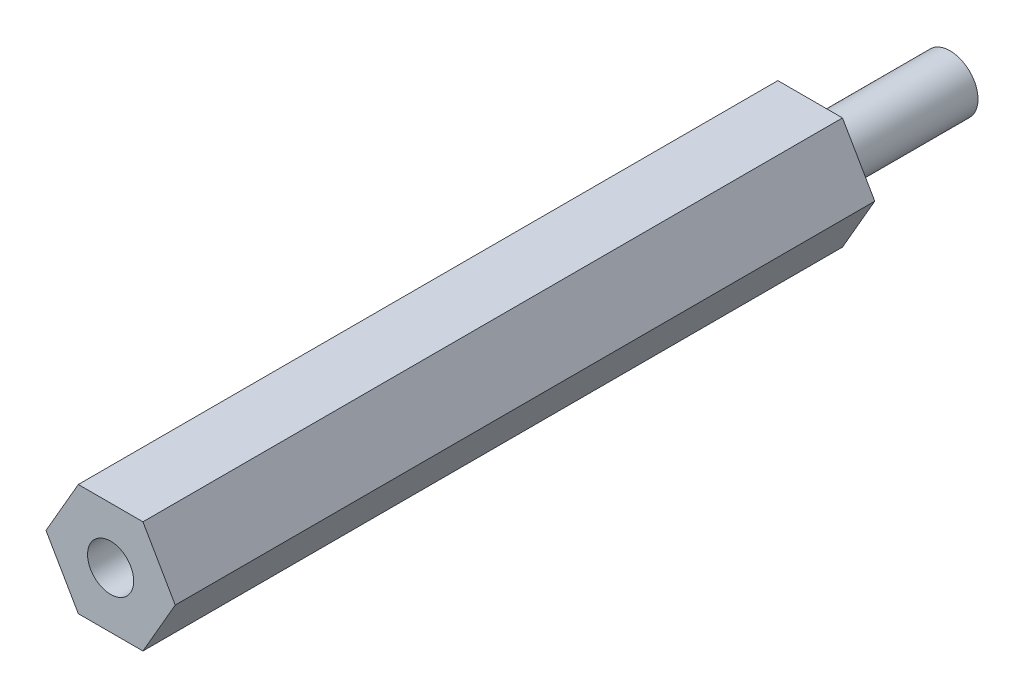
ISO-10303-21;
HEADER;
FILE_DESCRIPTION(('STEP AP214'),'2;1');
FILE_NAME('part.step','',(''),(''),'','','');
FILE_SCHEMA(('AUTOMOTIVE_DESIGN { 1 0 10303 214 1 1 1 1 }'));
ENDSEC;
DATA;
#1=APPLICATION_CONTEXT('core data for automotive mechanical design processes');
#2=APPLICATION_PROTOCOL_DEFINITION('international standard','automotive_design',2000,#1);
#3=PRODUCT_CONTEXT('',#1,'mechanical');
#4=PRODUCT('Part','Part','',(#3));
#5=PRODUCT_RELATED_PRODUCT_CATEGORY('part','',(#4));
#6=PRODUCT_DEFINITION_FORMATION('','',#4);
#7=PRODUCT_DEFINITION_CONTEXT('part definition',#1,'design');
#8=PRODUCT_DEFINITION('design','',#6,#7);
#9=PRODUCT_DEFINITION_SHAPE('','',#8);
#10=(LENGTH_UNIT() NAMED_UNIT(*) SI_UNIT(.MILLI.,.METRE.));
#11=(NAMED_UNIT(*) PLANE_ANGLE_UNIT() SI_UNIT($,.RADIAN.));
#12=(NAMED_UNIT(*) SI_UNIT($,.STERADIAN.) SOLID_ANGLE_UNIT());
#13=UNCERTAINTY_MEASURE_WITH_UNIT(LENGTH_MEASURE(1.E-05),#10,'distance_accuracy_value','');
#14=(GEOMETRIC_REPRESENTATION_CONTEXT(3) GLOBAL_UNCERTAINTY_ASSIGNED_CONTEXT((#13)) GLOBAL_UNIT_ASSIGNED_CONTEXT((#10,
#11,#12)) REPRESENTATION_CONTEXT('',''));
#15=CARTESIAN_POINT('',(0.,0.,0.));
#16=DIRECTION('',(0.,0.,1.));
#17=DIRECTION('',(1.,0.,0.));
#18=AXIS2_PLACEMENT_3D('',#15,#16,#17);
#19=CARTESIAN_POINT('',(2.3094010767585,4.,50.));
#20=DIRECTION('',(0.,-1.,0.));
#21=DIRECTION('',(1.,0.,0.));
#22=AXIS2_PLACEMENT_3D('',#19,#20,#21);
#23=PLANE('',#22);
#24=DIRECTION('',(-1.,0.,0.));
#25=VECTOR('',#24,1.);
#26=CARTESIAN_POINT('',(2.3094010767585,4.,0.));
#27=LINE('',#26,#25);
#28=CARTESIAN_POINT('',(2.3094010767585,4.,0.));
#29=VERTEX_POINT('',#28);
#30=CARTESIAN_POINT('',(-2.3094010767585,4.,0.));
#31=VERTEX_POINT('',#30);
#32=EDGE_CURVE('E127',#29,#31,#27,.T.);
#33=ORIENTED_EDGE('',*,*,#32,.T.);
#34=DIRECTION('',(0.,0.,-1.));
#35=VECTOR('',#34,1.);
#36=CARTESIAN_POINT('',(-2.3094010767585,4.,50.));
#37=LINE('',#36,#35);
#38=CARTESIAN_POINT('',(-2.3094010767585,4.,50.));
#39=VERTEX_POINT('',#38);
#40=EDGE_CURVE('E42',#39,#31,#37,.T.);
#41=ORIENTED_EDGE('',*,*,#40,.F.);
#42=DIRECTION('',(-1.,0.,0.));
#43=VECTOR('',#42,1.);
#44=CARTESIAN_POINT('',(2.3094010767585,4.,50.));
#45=LINE('',#44,#43);
#46=CARTESIAN_POINT('',(2.3094010767585,4.,50.));
#47=VERTEX_POINT('',#46);
#48=EDGE_CURVE('E138',#47,#39,#45,.T.);
#49=ORIENTED_EDGE('',*,*,#48,.F.);
#50=DIRECTION('',(0.,0.,-1.));
#51=VECTOR('',#50,1.);
#52=CARTESIAN_POINT('',(2.3094010767585,4.,50.));
#53=LINE('',#52,#51);
#54=EDGE_CURVE('E123',#47,#29,#53,.T.);
#55=ORIENTED_EDGE('',*,*,#54,.T.);
#56=EDGE_LOOP('',(#33,#41,#49,#55));
#57=FACE_BOUND('',#56,.T.);
#58=ADVANCED_FACE('F39',(#57),#23,.F.);
#59=CARTESIAN_POINT('',(-2.3094010767585,4.,50.));
#60=DIRECTION('',(0.866025403784439,-0.5,0.));
#61=DIRECTION('',(0.5,0.866025403784439,0.));
#62=AXIS2_PLACEMENT_3D('',#59,#60,#61);
#63=PLANE('',#62);
#64=DIRECTION('',(-0.5,-0.866025403784439,0.));
#65=VECTOR('',#64,1.);
#66=CARTESIAN_POINT('',(-2.3094010767585,4.,0.));
#67=LINE('',#66,#65);
#68=CARTESIAN_POINT('',(-4.61880215351701,0.,0.));
#69=VERTEX_POINT('',#68);
#70=EDGE_CURVE('E130',#31,#69,#67,.T.);
#71=ORIENTED_EDGE('',*,*,#70,.T.);
#72=DIRECTION('',(0.,0.,-1.));
#73=VECTOR('',#72,1.);
#74=CARTESIAN_POINT('',(-4.61880215351701,0.,50.));
#75=LINE('',#74,#73);
#76=CARTESIAN_POINT('',(-4.61880215351701,0.,50.));
#77=VERTEX_POINT('',#76);
#78=EDGE_CURVE('E141',#77,#69,#75,.T.);
#79=ORIENTED_EDGE('',*,*,#78,.F.);
#80=DIRECTION('',(-0.5,-0.866025403784439,0.));
#81=VECTOR('',#80,1.);
#82=CARTESIAN_POINT('',(-2.3094010767585,4.,50.));
#83=LINE('',#82,#81);
#84=EDGE_CURVE('E95',#39,#77,#83,.T.);
#85=ORIENTED_EDGE('',*,*,#84,.F.);
#86=ORIENTED_EDGE('',*,*,#40,.T.);
#87=EDGE_LOOP('',(#71,#79,#85,#86));
#88=FACE_BOUND('',#87,.T.);
#89=ADVANCED_FACE('F146',(#88),#63,.F.);
#90=CARTESIAN_POINT('',(-4.61880215351701,0.,50.));
#91=DIRECTION('',(0.866025403784439,0.5,0.));
#92=DIRECTION('',(-0.5,0.866025403784439,0.));
#93=AXIS2_PLACEMENT_3D('',#90,#91,#92);
#94=PLANE('',#93);
#95=DIRECTION('',(0.5,-0.866025403784439,0.));
#96=VECTOR('',#95,1.);
#97=CARTESIAN_POINT('',(-4.61880215351701,0.,0.));
#98=LINE('',#97,#96);
#99=CARTESIAN_POINT('',(-2.3094010767585,-4.,0.));
#100=VERTEX_POINT('',#99);
#101=EDGE_CURVE('E133',#69,#100,#98,.T.);
#102=ORIENTED_EDGE('',*,*,#101,.T.);
#103=DIRECTION('',(0.,0.,-1.));
#104=VECTOR('',#103,1.);
#105=CARTESIAN_POINT('',(-2.3094010767585,-4.,50.));
#106=LINE('',#105,#104);
#107=CARTESIAN_POINT('',(-2.3094010767585,-4.,50.));
#108=VERTEX_POINT('',#107);
#109=EDGE_CURVE('E118',#108,#100,#106,.T.);
#110=ORIENTED_EDGE('',*,*,#109,.F.);
#111=DIRECTION('',(0.5,-0.866025403784439,0.));
#112=VECTOR('',#111,1.);
#113=CARTESIAN_POINT('',(-4.61880215351701,0.,50.));
#114=LINE('',#113,#112);
#115=EDGE_CURVE('E109',#77,#108,#114,.T.);
#116=ORIENTED_EDGE('',*,*,#115,.F.);
#117=ORIENTED_EDGE('',*,*,#78,.T.);
#118=EDGE_LOOP('',(#102,#110,#116,#117));
#119=FACE_BOUND('',#118,.T.);
#120=ADVANCED_FACE('F152',(#119),#94,.F.);
#121=CARTESIAN_POINT('',(-2.3094010767585,-4.,50.));
#122=DIRECTION('',(0.,1.,0.));
#123=DIRECTION('',(-1.,0.,0.));
#124=AXIS2_PLACEMENT_3D('',#121,#122,#123);
#125=PLANE('',#124);
#126=DIRECTION('',(1.,0.,0.));
#127=VECTOR('',#126,1.);
#128=CARTESIAN_POINT('',(-2.3094010767585,-4.,0.));
#129=LINE('',#128,#127);
#130=CARTESIAN_POINT('',(2.3094010767585,-4.,0.));
#131=VERTEX_POINT('',#130);
#132=EDGE_CURVE('E117',#100,#131,#129,.T.);
#133=ORIENTED_EDGE('',*,*,#132,.T.);
#134=DIRECTION('',(0.,0.,-1.));
#135=VECTOR('',#134,1.);
#136=CARTESIAN_POINT('',(2.3094010767585,-4.,50.));
#137=LINE('',#136,#135);
#138=CARTESIAN_POINT('',(2.3094010767585,-4.,50.));
#139=VERTEX_POINT('',#138);
#140=EDGE_CURVE('E114',#139,#131,#137,.T.);
#141=ORIENTED_EDGE('',*,*,#140,.F.);
#142=DIRECTION('',(1.,0.,0.));
#143=VECTOR('',#142,1.);
#144=CARTESIAN_POINT('',(-2.3094010767585,-4.,50.));
#145=LINE('',#144,#143);
#146=EDGE_CURVE('E103',#108,#139,#145,.T.);
#147=ORIENTED_EDGE('',*,*,#146,.F.);
#148=ORIENTED_EDGE('',*,*,#109,.T.);
#149=EDGE_LOOP('',(#133,#141,#147,#148));
#150=FACE_BOUND('',#149,.T.);
#151=ADVANCED_FACE('F115',(#150),#125,.F.);
#152=CARTESIAN_POINT('',(2.3094010767585,-4.,50.));
#153=DIRECTION('',(-0.866025403784439,0.5,0.));
#154=DIRECTION('',(-0.5,-0.866025403784439,0.));
#155=AXIS2_PLACEMENT_3D('',#152,#153,#154);
#156=PLANE('',#155);
#157=DIRECTION('',(0.5,0.866025403784439,0.));
#158=VECTOR('',#157,1.);
#159=CARTESIAN_POINT('',(2.3094010767585,-4.,0.));
#160=LINE('',#159,#158);
#161=CARTESIAN_POINT('',(4.618802153517,0.,0.));
#162=VERTEX_POINT('',#161);
#163=EDGE_CURVE('E80',#131,#162,#160,.T.);
#164=ORIENTED_EDGE('',*,*,#163,.T.);
#165=DIRECTION('',(0.,0.,-1.));
#166=VECTOR('',#165,1.);
#167=CARTESIAN_POINT('',(4.618802153517,0.,50.));
#168=LINE('',#167,#166);
#169=CARTESIAN_POINT('',(4.618802153517,0.,50.));
#170=VERTEX_POINT('',#169);
#171=EDGE_CURVE('E119',#170,#162,#168,.T.);
#172=ORIENTED_EDGE('',*,*,#171,.F.);
#173=DIRECTION('',(0.5,0.866025403784439,0.));
#174=VECTOR('',#173,1.);
#175=CARTESIAN_POINT('',(2.3094010767585,-4.,50.));
#176=LINE('',#175,#174);
#177=EDGE_CURVE('E107',#139,#170,#176,.T.);
#178=ORIENTED_EDGE('',*,*,#177,.F.);
#179=ORIENTED_EDGE('',*,*,#140,.T.);
#180=EDGE_LOOP('',(#164,#172,#178,#179));
#181=FACE_BOUND('',#180,.T.);
#182=ADVANCED_FACE('F121',(#181),#156,.F.);
#183=CARTESIAN_POINT('',(4.618802153517,0.,50.));
#184=DIRECTION('',(-0.866025403784439,-0.5,0.));
#185=DIRECTION('',(0.5,-0.866025403784439,0.));
#186=AXIS2_PLACEMENT_3D('',#183,#184,#185);
#187=PLANE('',#186);
#188=DIRECTION('',(-0.5,0.866025403784439,0.));
#189=VECTOR('',#188,1.);
#190=CARTESIAN_POINT('',(4.618802153517,0.,0.));
#191=LINE('',#190,#189);
#192=EDGE_CURVE('E86',#162,#29,#191,.T.);
#193=ORIENTED_EDGE('',*,*,#192,.T.);
#194=ORIENTED_EDGE('',*,*,#54,.F.);
#195=DIRECTION('',(-0.5,0.866025403784439,0.));
#196=VECTOR('',#195,1.);
#197=CARTESIAN_POINT('',(4.618802153517,0.,50.));
#198=LINE('',#197,#196);
#199=EDGE_CURVE('E56',#170,#47,#198,.T.);
#200=ORIENTED_EDGE('',*,*,#199,.F.);
#201=ORIENTED_EDGE('',*,*,#171,.T.);
#202=EDGE_LOOP('',(#193,#194,#200,#201));
#203=FACE_BOUND('',#202,.T.);
#204=ADVANCED_FACE('F168',(#203),#187,.F.);
#205=CARTESIAN_POINT('',(0.,0.,50.));
#206=DIRECTION('',(0.,0.,1.));
#207=DIRECTION('',(1.,0.,0.));
#208=AXIS2_PLACEMENT_3D('',#205,#206,#207);
#209=PLANE('',#208);
#210=CARTESIAN_POINT('',(0.,0.,50.));
#211=DIRECTION('',(0.,0.,1.));
#212=DIRECTION('',(1.,0.,0.));
#213=AXIS2_PLACEMENT_3D('',#210,#211,#212);
#214=CIRCLE('',#213,1.65);
#215=CARTESIAN_POINT('',(1.65,0.,50.));
#216=VERTEX_POINT('',#215);
#217=EDGE_CURVE('E161',#216,#216,#214,.T.);
#218=ORIENTED_EDGE('',*,*,#217,.F.);
#219=EDGE_LOOP('',(#218));
#220=FACE_BOUND('',#219,.T.);
#221=ORIENTED_EDGE('',*,*,#48,.T.);
#222=ORIENTED_EDGE('',*,*,#84,.T.);
#223=ORIENTED_EDGE('',*,*,#115,.T.);
#224=ORIENTED_EDGE('',*,*,#146,.T.);
#225=ORIENTED_EDGE('',*,*,#177,.T.);
#226=ORIENTED_EDGE('',*,*,#199,.T.);
#227=EDGE_LOOP('',(#221,#222,#223,#224,#225,#226));
#228=FACE_BOUND('',#227,.T.);
#229=ADVANCED_FACE('F105',(#220,#228),#209,.T.);
#230=CARTESIAN_POINT('',(0.,0.,0.));
#231=DIRECTION('',(0.,0.,1.));
#232=DIRECTION('',(1.,0.,0.));
#233=AXIS2_PLACEMENT_3D('',#230,#231,#232);
#234=PLANE('',#233);
#235=CARTESIAN_POINT('',(0.,0.,0.));
#236=DIRECTION('',(0.,0.,-1.));
#237=DIRECTION('',(-1.,0.,0.));
#238=AXIS2_PLACEMENT_3D('',#235,#236,#237);
#239=CIRCLE('',#238,2.);
#240=CARTESIAN_POINT('',(-2.,0.,0.));
#241=VERTEX_POINT('',#240);
#242=EDGE_CURVE('E11',#241,#241,#239,.T.);
#243=ORIENTED_EDGE('',*,*,#242,.F.);
#244=EDGE_LOOP('',(#243));
#245=FACE_BOUND('',#244,.T.);
#246=ORIENTED_EDGE('',*,*,#32,.F.);
#247=ORIENTED_EDGE('',*,*,#192,.F.);
#248=ORIENTED_EDGE('',*,*,#163,.F.);
#249=ORIENTED_EDGE('',*,*,#132,.F.);
#250=ORIENTED_EDGE('',*,*,#101,.F.);
#251=ORIENTED_EDGE('',*,*,#70,.F.);
#252=EDGE_LOOP('',(#246,#247,#248,#249,#250,#251));
#253=FACE_BOUND('',#252,.T.);
#254=ADVANCED_FACE('F151',(#245,#253),#234,.F.);
#255=CARTESIAN_POINT('',(0.,0.,-10.));
#256=DIRECTION('',(0.,0.,1.));
#257=DIRECTION('',(1.,0.,0.));
#258=AXIS2_PLACEMENT_3D('',#255,#256,#257);
#259=CYLINDRICAL_SURFACE('',#258,2.);
#260=CARTESIAN_POINT('',(0.,0.,-10.));
#261=DIRECTION('',(0.,0.,-1.));
#262=DIRECTION('',(-1.,0.,0.));
#263=AXIS2_PLACEMENT_3D('',#260,#261,#262);
#264=CIRCLE('',#263,2.);
#265=CARTESIAN_POINT('',(-2.,0.,-10.));
#266=VERTEX_POINT('',#265);
#267=EDGE_CURVE('E131',#266,#266,#264,.T.);
#268=ORIENTED_EDGE('',*,*,#267,.F.);
#269=EDGE_LOOP('',(#268));
#270=FACE_BOUND('',#269,.T.);
#271=ORIENTED_EDGE('',*,*,#242,.T.);
#272=EDGE_LOOP('',(#271));
#273=FACE_BOUND('',#272,.T.);
#274=ADVANCED_FACE('F174',(#270,#273),#259,.T.);
#275=CARTESIAN_POINT('',(0.,0.,-10.));
#276=DIRECTION('',(0.,0.,-1.));
#277=DIRECTION('',(-1.,0.,0.));
#278=AXIS2_PLACEMENT_3D('',#275,#276,#277);
#279=PLANE('',#278);
#280=ORIENTED_EDGE('',*,*,#267,.T.);
#281=EDGE_LOOP('',(#280));
#282=FACE_BOUND('',#281,.T.);
#283=ADVANCED_FACE('F215',(#282),#279,.T.);
#284=CARTESIAN_POINT('',(0.,0.,39.9));
#285=DIRECTION('',(0.,0.,1.));
#286=DIRECTION('',(1.,0.,0.));
#287=AXIS2_PLACEMENT_3D('',#284,#285,#286);
#288=CONICAL_SURFACE('',#287,1.65,1.02974425867665);
#289=CARTESIAN_POINT('',(0.,0.,38.9085799786045));
#290=VERTEX_POINT('',#289);
#291=VERTEX_LOOP('',#290);
#292=FACE_BOUND('',#291,.T.);
#293=CARTESIAN_POINT('',(0.,0.,39.9));
#294=DIRECTION('',(0.,0.,1.));
#295=DIRECTION('',(1.,0.,0.));
#296=AXIS2_PLACEMENT_3D('',#293,#294,#295);
#297=CIRCLE('',#296,1.65);
#298=CARTESIAN_POINT('',(1.65,0.,39.9));
#299=VERTEX_POINT('',#298);
#300=EDGE_CURVE('E158',#299,#299,#297,.T.);
#301=ORIENTED_EDGE('',*,*,#300,.T.);
#302=EDGE_LOOP('',(#301));
#303=FACE_BOUND('',#302,.T.);
#304=ADVANCED_FACE('F223',(#292,#303),#288,.F.);
#305=CARTESIAN_POINT('',(0.,0.,50.));
#306=DIRECTION('',(0.,0.,1.));
#307=DIRECTION('',(1.,0.,0.));
#308=AXIS2_PLACEMENT_3D('',#305,#306,#307);
#309=CYLINDRICAL_SURFACE('',#308,1.65);
#310=ORIENTED_EDGE('',*,*,#300,.F.);
#311=EDGE_LOOP('',(#310));
#312=FACE_BOUND('',#311,.T.);
#313=ORIENTED_EDGE('',*,*,#217,.T.);
#314=EDGE_LOOP('',(#313));
#315=FACE_BOUND('',#314,.T.);
#316=ADVANCED_FACE('F165',(#312,#315),#309,.F.);
#317=CLOSED_SHELL('',(#58,#89,#120,#151,#182,#204,#229,#254,#274,#283,#304,#316));
#318=MANIFOLD_SOLID_BREP('B2',#317);
#319=ADVANCED_BREP_SHAPE_REPRESENTATION('',(#18,#318),#14);
#320=SHAPE_DEFINITION_REPRESENTATION(#9,#319);
ENDSEC;
END-ISO-10303-21;
